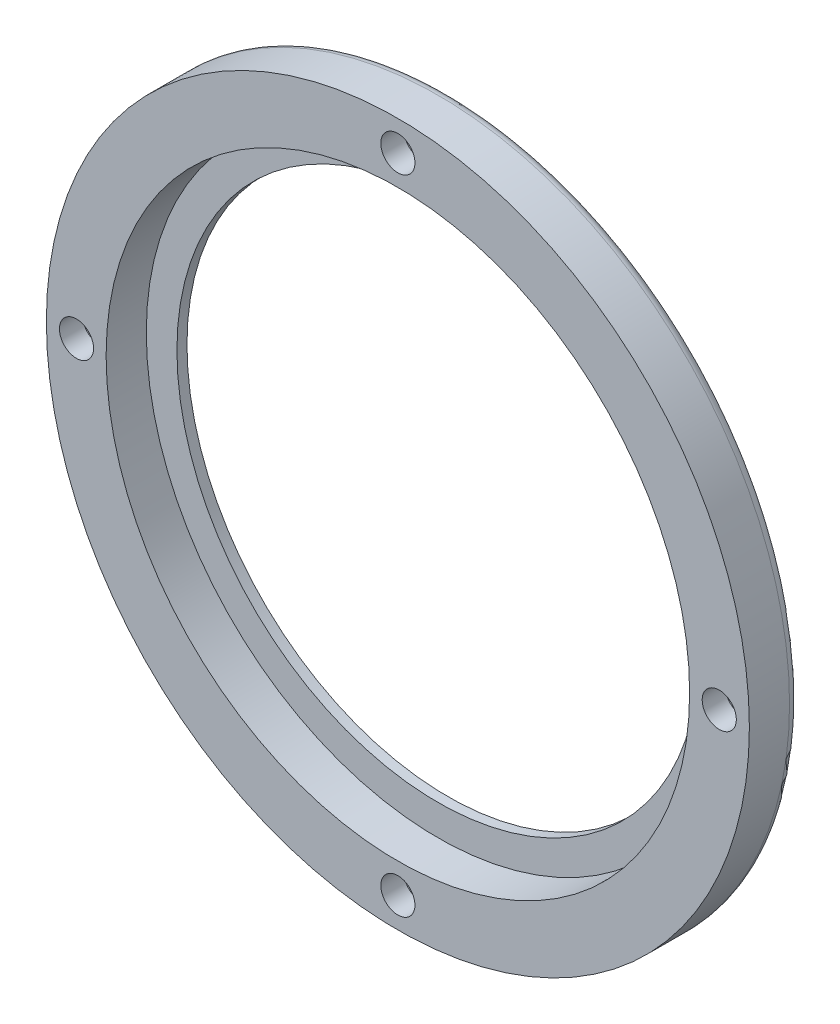
ISO-10303-21;
HEADER;
FILE_DESCRIPTION(('STEP AP214'),'2;1');
FILE_NAME('part.step','',(''),(''),'','','');
FILE_SCHEMA(('AUTOMOTIVE_DESIGN { 1 0 10303 214 1 1 1 1 }'));
ENDSEC;
DATA;
#1=APPLICATION_CONTEXT('core data for automotive mechanical design processes');
#2=APPLICATION_PROTOCOL_DEFINITION('international standard','automotive_design',2000,#1);
#3=PRODUCT_CONTEXT('',#1,'mechanical');
#4=PRODUCT('Part','Part','',(#3));
#5=PRODUCT_RELATED_PRODUCT_CATEGORY('part','',(#4));
#6=PRODUCT_DEFINITION_FORMATION('','',#4);
#7=PRODUCT_DEFINITION_CONTEXT('part definition',#1,'design');
#8=PRODUCT_DEFINITION('design','',#6,#7);
#9=PRODUCT_DEFINITION_SHAPE('','',#8);
#10=(LENGTH_UNIT() NAMED_UNIT(*) SI_UNIT(.MILLI.,.METRE.));
#11=(NAMED_UNIT(*) PLANE_ANGLE_UNIT() SI_UNIT($,.RADIAN.));
#12=(NAMED_UNIT(*) SI_UNIT($,.STERADIAN.) SOLID_ANGLE_UNIT());
#13=UNCERTAINTY_MEASURE_WITH_UNIT(LENGTH_MEASURE(1.E-05),#10,'distance_accuracy_value','');
#14=(GEOMETRIC_REPRESENTATION_CONTEXT(3) GLOBAL_UNCERTAINTY_ASSIGNED_CONTEXT((#13)) GLOBAL_UNIT_ASSIGNED_CONTEXT((#10,
#11,#12)) REPRESENTATION_CONTEXT('',''));
#15=CARTESIAN_POINT('',(0.,0.,0.));
#16=DIRECTION('',(0.,0.,1.));
#17=DIRECTION('',(1.,0.,0.));
#18=AXIS2_PLACEMENT_3D('',#15,#16,#17);
#19=CARTESIAN_POINT('',(-32.,0.,-29.));
#20=DIRECTION('',(0.,0.,-1.));
#21=DIRECTION('',(-1.,0.,0.));
#22=AXIS2_PLACEMENT_3D('',#19,#20,#21);
#23=CYLINDRICAL_SURFACE('',#22,1.69999999999999);
#24=CARTESIAN_POINT('',(-32.,0.,-24.));
#25=DIRECTION('',(0.,0.,-1.));
#26=DIRECTION('',(-1.,0.,0.));
#27=AXIS2_PLACEMENT_3D('',#24,#25,#26);
#28=CIRCLE('',#27,1.69999999999999);
#29=CARTESIAN_POINT('',(-33.7,0.,-24.));
#30=VERTEX_POINT('',#29);
#31=EDGE_CURVE('E114',#30,#30,#28,.T.);
#32=ORIENTED_EDGE('',*,*,#31,.F.);
#33=EDGE_LOOP('',(#32));
#34=FACE_BOUND('',#33,.T.);
#35=CARTESIAN_POINT('',(-32.,0.,-26.3));
#36=DIRECTION('',(0.,0.,-1.));
#37=DIRECTION('',(-1.,0.,0.));
#38=AXIS2_PLACEMENT_3D('',#35,#36,#37);
#39=CIRCLE('',#38,1.69999999999999);
#40=CARTESIAN_POINT('',(-33.7,0.,-26.3));
#41=VERTEX_POINT('',#40);
#42=EDGE_CURVE('E45',#41,#41,#39,.F.);
#43=ORIENTED_EDGE('',*,*,#42,.F.);
#44=EDGE_LOOP('',(#43));
#45=FACE_BOUND('',#44,.T.);
#46=ADVANCED_FACE('F40',(#34,#45),#23,.F.);
#47=CARTESIAN_POINT('',(0.,32.,-29.));
#48=DIRECTION('',(0.,0.,-1.));
#49=DIRECTION('',(-1.,0.,0.));
#50=AXIS2_PLACEMENT_3D('',#47,#48,#49);
#51=CYLINDRICAL_SURFACE('',#50,1.69999999999999);
#52=CARTESIAN_POINT('',(0.,32.,-24.));
#53=DIRECTION('',(0.,0.,-1.));
#54=DIRECTION('',(-1.,0.,0.));
#55=AXIS2_PLACEMENT_3D('',#52,#53,#54);
#56=CIRCLE('',#55,1.69999999999999);
#57=CARTESIAN_POINT('',(-1.69999999999999,32.,-24.));
#58=VERTEX_POINT('',#57);
#59=EDGE_CURVE('E119',#58,#58,#56,.T.);
#60=ORIENTED_EDGE('',*,*,#59,.F.);
#61=EDGE_LOOP('',(#60));
#62=FACE_BOUND('',#61,.T.);
#63=CARTESIAN_POINT('',(0.,32.,-26.3));
#64=DIRECTION('',(0.,0.,-1.));
#65=DIRECTION('',(-1.,0.,0.));
#66=AXIS2_PLACEMENT_3D('',#63,#64,#65);
#67=CIRCLE('',#66,1.69999999999999);
#68=CARTESIAN_POINT('',(-1.69999999999999,32.,-26.3));
#69=VERTEX_POINT('',#68);
#70=EDGE_CURVE('E163',#69,#69,#67,.F.);
#71=ORIENTED_EDGE('',*,*,#70,.F.);
#72=EDGE_LOOP('',(#71));
#73=FACE_BOUND('',#72,.T.);
#74=ADVANCED_FACE('F180',(#62,#73),#51,.F.);
#75=CARTESIAN_POINT('',(32.,0.,-29.));
#76=DIRECTION('',(0.,0.,-1.));
#77=DIRECTION('',(-1.,0.,0.));
#78=AXIS2_PLACEMENT_3D('',#75,#76,#77);
#79=CYLINDRICAL_SURFACE('',#78,1.69999999999999);
#80=CARTESIAN_POINT('',(32.,0.,-24.));
#81=DIRECTION('',(0.,0.,-1.));
#82=DIRECTION('',(-1.,0.,0.));
#83=AXIS2_PLACEMENT_3D('',#80,#81,#82);
#84=CIRCLE('',#83,1.69999999999999);
#85=CARTESIAN_POINT('',(30.3,0.,-24.));
#86=VERTEX_POINT('',#85);
#87=EDGE_CURVE('E122',#86,#86,#84,.T.);
#88=ORIENTED_EDGE('',*,*,#87,.F.);
#89=EDGE_LOOP('',(#88));
#90=FACE_BOUND('',#89,.T.);
#91=CARTESIAN_POINT('',(32.,0.,-26.3));
#92=DIRECTION('',(0.,0.,-1.));
#93=DIRECTION('',(-1.,0.,0.));
#94=AXIS2_PLACEMENT_3D('',#91,#92,#93);
#95=CIRCLE('',#94,1.69999999999999);
#96=CARTESIAN_POINT('',(30.3,0.,-26.3));
#97=VERTEX_POINT('',#96);
#98=EDGE_CURVE('E158',#97,#97,#95,.F.);
#99=ORIENTED_EDGE('',*,*,#98,.F.);
#100=EDGE_LOOP('',(#99));
#101=FACE_BOUND('',#100,.T.);
#102=ADVANCED_FACE('F186',(#90,#101),#79,.F.);
#103=CARTESIAN_POINT('',(0.,-32.,-29.));
#104=DIRECTION('',(0.,0.,-1.));
#105=DIRECTION('',(-1.,0.,0.));
#106=AXIS2_PLACEMENT_3D('',#103,#104,#105);
#107=CYLINDRICAL_SURFACE('',#106,1.69999999999999);
#108=CARTESIAN_POINT('',(0.,-32.,-24.));
#109=DIRECTION('',(0.,0.,-1.));
#110=DIRECTION('',(-1.,0.,0.));
#111=AXIS2_PLACEMENT_3D('',#108,#109,#110);
#112=CIRCLE('',#111,1.69999999999999);
#113=CARTESIAN_POINT('',(-1.69999999999999,-32.,-24.));
#114=VERTEX_POINT('',#113);
#115=EDGE_CURVE('E125',#114,#114,#112,.T.);
#116=ORIENTED_EDGE('',*,*,#115,.F.);
#117=EDGE_LOOP('',(#116));
#118=FACE_BOUND('',#117,.T.);
#119=CARTESIAN_POINT('',(0.,-32.,-26.3));
#120=DIRECTION('',(0.,0.,-1.));
#121=DIRECTION('',(-1.,0.,0.));
#122=AXIS2_PLACEMENT_3D('',#119,#120,#121);
#123=CIRCLE('',#122,1.69999999999999);
#124=CARTESIAN_POINT('',(-1.69999999999999,-32.,-26.3));
#125=VERTEX_POINT('',#124);
#126=EDGE_CURVE('E154',#125,#125,#123,.F.);
#127=ORIENTED_EDGE('',*,*,#126,.F.);
#128=EDGE_LOOP('',(#127));
#129=FACE_BOUND('',#128,.T.);
#130=ADVANCED_FACE('F200',(#118,#129),#107,.F.);
#131=CARTESIAN_POINT('',(0.,0.,-29.));
#132=DIRECTION('',(0.,0.,1.));
#133=DIRECTION('',(1.,0.,0.));
#134=AXIS2_PLACEMENT_3D('',#131,#132,#133);
#135=CYLINDRICAL_SURFACE('',#134,35.);
#136=CARTESIAN_POINT('',(0.,0.,-28.));
#137=DIRECTION('',(0.,0.,-1.));
#138=DIRECTION('',(-1.,0.,0.));
#139=AXIS2_PLACEMENT_3D('',#136,#137,#138);
#140=CIRCLE('',#139,35.);
#141=CARTESIAN_POINT('',(-35.,0.,-28.));
#142=VERTEX_POINT('',#141);
#143=EDGE_CURVE('E107',#142,#142,#140,.F.);
#144=ORIENTED_EDGE('',*,*,#143,.T.);
#145=EDGE_LOOP('',(#144));
#146=FACE_BOUND('',#145,.T.);
#147=CARTESIAN_POINT('',(0.,0.,-24.));
#148=DIRECTION('',(0.,0.,1.));
#149=DIRECTION('',(1.,0.,0.));
#150=AXIS2_PLACEMENT_3D('',#147,#148,#149);
#151=CIRCLE('',#150,35.);
#152=CARTESIAN_POINT('',(35.,0.,-24.));
#153=VERTEX_POINT('',#152);
#154=EDGE_CURVE('E110',#153,#153,#151,.T.);
#155=ORIENTED_EDGE('',*,*,#154,.F.);
#156=EDGE_LOOP('',(#155));
#157=FACE_BOUND('',#156,.T.);
#158=ADVANCED_FACE('F198',(#146,#157),#135,.T.);
#159=CARTESIAN_POINT('',(35.,0.,-29.));
#160=DIRECTION('',(0.,0.,-1.));
#161=DIRECTION('',(-1.,0.,0.));
#162=AXIS2_PLACEMENT_3D('',#159,#160,#161);
#163=PLANE('',#162);
#164=CARTESIAN_POINT('',(0.,-32.,-29.));
#165=DIRECTION('',(0.,0.,-1.));
#166=DIRECTION('',(-1.,0.,0.));
#167=AXIS2_PLACEMENT_3D('',#164,#165,#166);
#168=CIRCLE('',#167,2.8);
#169=CARTESIAN_POINT('',(-2.01900965822356,-33.94,-29.));
#170=VERTEX_POINT('',#169);
#171=CARTESIAN_POINT('',(2.01900965822355,-33.94,-29.));
#172=VERTEX_POINT('',#171);
#173=EDGE_CURVE('E63',#170,#172,#168,.T.);
#174=ORIENTED_EDGE('',*,*,#173,.F.);
#175=CARTESIAN_POINT('',(0.,0.,-29.));
#176=DIRECTION('',(0.,0.,-1.));
#177=DIRECTION('',(-1.,0.,0.));
#178=AXIS2_PLACEMENT_3D('',#175,#176,#177);
#179=CIRCLE('',#178,34.);
#180=CARTESIAN_POINT('',(-33.94,-2.0190096582239,-29.));
#181=VERTEX_POINT('',#180);
#182=EDGE_CURVE('E95',#170,#181,#179,.T.);
#183=ORIENTED_EDGE('',*,*,#182,.T.);
#184=CARTESIAN_POINT('',(-32.,-3.29214771340949E-13,-29.));
#185=DIRECTION('',(0.,0.,-1.));
#186=DIRECTION('',(-1.,0.,0.));
#187=AXIS2_PLACEMENT_3D('',#184,#185,#186);
#188=CIRCLE('',#187,2.8);
#189=CARTESIAN_POINT('',(-33.94,2.0190096582232,-29.));
#190=VERTEX_POINT('',#189);
#191=EDGE_CURVE('E57',#190,#181,#188,.T.);
#192=ORIENTED_EDGE('',*,*,#191,.F.);
#193=CARTESIAN_POINT('',(-2.01900965822379,33.94,-29.));
#194=VERTEX_POINT('',#193);
#195=EDGE_CURVE('E88',#190,#194,#179,.T.);
#196=ORIENTED_EDGE('',*,*,#195,.T.);
#197=CARTESIAN_POINT('',(-2.17487368497969E-13,32.,-29.));
#198=DIRECTION('',(0.,0.,-1.));
#199=DIRECTION('',(-1.,0.,0.));
#200=AXIS2_PLACEMENT_3D('',#197,#198,#199);
#201=CIRCLE('',#200,2.8);
#202=CARTESIAN_POINT('',(2.01900965822333,33.94,-29.));
#203=VERTEX_POINT('',#202);
#204=EDGE_CURVE('E144',#203,#194,#201,.T.);
#205=ORIENTED_EDGE('',*,*,#204,.F.);
#206=CARTESIAN_POINT('',(33.94,2.01900965822367,-29.));
#207=VERTEX_POINT('',#206);
#208=EDGE_CURVE('E102',#203,#207,#179,.T.);
#209=ORIENTED_EDGE('',*,*,#208,.T.);
#210=CARTESIAN_POINT('',(32.,1.05759965654989E-13,-29.));
#211=DIRECTION('',(0.,0.,-1.));
#212=DIRECTION('',(-1.,0.,0.));
#213=AXIS2_PLACEMENT_3D('',#210,#211,#212);
#214=CIRCLE('',#213,2.8);
#215=CARTESIAN_POINT('',(33.94,-2.01900965822344,-29.));
#216=VERTEX_POINT('',#215);
#217=EDGE_CURVE('E149',#216,#207,#214,.T.);
#218=ORIENTED_EDGE('',*,*,#217,.F.);
#219=EDGE_CURVE('E105',#216,#172,#179,.T.);
#220=ORIENTED_EDGE('',*,*,#219,.T.);
#221=EDGE_LOOP('',(#174,#183,#192,#196,#205,#209,#218,#220));
#222=FACE_BOUND('',#221,.T.);
#223=CARTESIAN_POINT('',(0.,0.,-29.));
#224=DIRECTION('',(0.,0.,1.));
#225=DIRECTION('',(1.,0.,0.));
#226=AXIS2_PLACEMENT_3D('',#223,#224,#225);
#227=CIRCLE('',#226,26.);
#228=CARTESIAN_POINT('',(26.,0.,-29.));
#229=VERTEX_POINT('',#228);
#230=EDGE_CURVE('E128',#229,#229,#227,.T.);
#231=ORIENTED_EDGE('',*,*,#230,.T.);
#232=EDGE_LOOP('',(#231));
#233=FACE_BOUND('',#232,.T.);
#234=ADVANCED_FACE('F92',(#222,#233),#163,.T.);
#235=CARTESIAN_POINT('',(0.,0.,-24.));
#236=DIRECTION('',(0.,0.,1.));
#237=DIRECTION('',(1.,0.,0.));
#238=AXIS2_PLACEMENT_3D('',#235,#236,#237);
#239=PLANE('',#238);
#240=CARTESIAN_POINT('',(0.,0.,-24.));
#241=DIRECTION('',(0.,0.,1.));
#242=DIRECTION('',(1.,0.,0.));
#243=AXIS2_PLACEMENT_3D('',#240,#241,#242);
#244=CIRCLE('',#243,29.05);
#245=CARTESIAN_POINT('',(29.05,0.,-24.));
#246=VERTEX_POINT('',#245);
#247=EDGE_CURVE('E137',#246,#246,#244,.T.);
#248=ORIENTED_EDGE('',*,*,#247,.F.);
#249=EDGE_LOOP('',(#248));
#250=FACE_BOUND('',#249,.T.);
#251=ORIENTED_EDGE('',*,*,#115,.T.);
#252=EDGE_LOOP('',(#251));
#253=FACE_BOUND('',#252,.T.);
#254=ORIENTED_EDGE('',*,*,#87,.T.);
#255=EDGE_LOOP('',(#254));
#256=FACE_BOUND('',#255,.T.);
#257=ORIENTED_EDGE('',*,*,#59,.T.);
#258=EDGE_LOOP('',(#257));
#259=FACE_BOUND('',#258,.T.);
#260=ORIENTED_EDGE('',*,*,#31,.T.);
#261=EDGE_LOOP('',(#260));
#262=FACE_BOUND('',#261,.T.);
#263=ORIENTED_EDGE('',*,*,#154,.T.);
#264=EDGE_LOOP('',(#263));
#265=FACE_BOUND('',#264,.T.);
#266=ADVANCED_FACE('F192',(#250,#253,#256,#259,#262,#265),#239,.T.);
#267=CARTESIAN_POINT('',(0.,0.,-24.));
#268=DIRECTION('',(0.,0.,1.));
#269=DIRECTION('',(1.,0.,0.));
#270=AXIS2_PLACEMENT_3D('',#267,#268,#269);
#271=CYLINDRICAL_SURFACE('',#270,26.);
#272=ORIENTED_EDGE('',*,*,#230,.F.);
#273=EDGE_LOOP('',(#272));
#274=FACE_BOUND('',#273,.T.);
#275=CARTESIAN_POINT('',(0.,0.,-28.));
#276=DIRECTION('',(0.,0.,1.));
#277=DIRECTION('',(1.,0.,0.));
#278=AXIS2_PLACEMENT_3D('',#275,#276,#277);
#279=CIRCLE('',#278,26.);
#280=CARTESIAN_POINT('',(26.,0.,-28.));
#281=VERTEX_POINT('',#280);
#282=EDGE_CURVE('E131',#281,#281,#279,.T.);
#283=ORIENTED_EDGE('',*,*,#282,.T.);
#284=EDGE_LOOP('',(#283));
#285=FACE_BOUND('',#284,.T.);
#286=ADVANCED_FACE('F195',(#274,#285),#271,.F.);
#287=CARTESIAN_POINT('',(26.,0.,-28.));
#288=DIRECTION('',(0.,0.,-1.));
#289=DIRECTION('',(-1.,0.,0.));
#290=AXIS2_PLACEMENT_3D('',#287,#288,#289);
#291=PLANE('',#290);
#292=ORIENTED_EDGE('',*,*,#282,.F.);
#293=EDGE_LOOP('',(#292));
#294=FACE_BOUND('',#293,.T.);
#295=CARTESIAN_POINT('',(0.,0.,-28.));
#296=DIRECTION('',(0.,0.,1.));
#297=DIRECTION('',(1.,0.,0.));
#298=AXIS2_PLACEMENT_3D('',#295,#296,#297);
#299=CIRCLE('',#298,29.05);
#300=CARTESIAN_POINT('',(29.05,0.,-28.));
#301=VERTEX_POINT('',#300);
#302=EDGE_CURVE('E134',#301,#301,#299,.T.);
#303=ORIENTED_EDGE('',*,*,#302,.T.);
#304=EDGE_LOOP('',(#303));
#305=FACE_BOUND('',#304,.T.);
#306=ADVANCED_FACE('F218',(#294,#305),#291,.F.);
#307=CARTESIAN_POINT('',(0.,0.,-24.));
#308=DIRECTION('',(0.,0.,1.));
#309=DIRECTION('',(1.,0.,0.));
#310=AXIS2_PLACEMENT_3D('',#307,#308,#309);
#311=CYLINDRICAL_SURFACE('',#310,29.05);
#312=ORIENTED_EDGE('',*,*,#302,.F.);
#313=EDGE_LOOP('',(#312));
#314=FACE_BOUND('',#313,.T.);
#315=ORIENTED_EDGE('',*,*,#247,.T.);
#316=EDGE_LOOP('',(#315));
#317=FACE_BOUND('',#316,.T.);
#318=ADVANCED_FACE('F222',(#314,#317),#311,.F.);
#319=CARTESIAN_POINT('',(0.,0.,-28.));
#320=DIRECTION('',(0.,0.,-1.));
#321=DIRECTION('',(-1.,0.,0.));
#322=AXIS2_PLACEMENT_3D('',#319,#320,#321);
#323=TOROIDAL_SURFACE('',#322,34.,1.);
#324=CARTESIAN_POINT('',(2.65373843804049,-32.893125020625,-27.9998));
#325=CARTESIAN_POINT('',(2.65373821407248,-32.8931190466075,-28.0258151181649));
#326=CARTESIAN_POINT('',(2.65338969688123,-32.8941619710773,-28.0518179000067));
#327=CARTESIAN_POINT('',(2.65198304225009,-32.8983279453459,-28.10363496629));
#328=CARTESIAN_POINT('',(2.6509249585492,-32.9014508376183,-28.1294492648568));
#329=CARTESIAN_POINT('',(2.64667327298988,-32.9138940591094,-28.2062515095137));
#330=CARTESIAN_POINT('',(2.64240234831206,-32.9262890894787,-28.2567201625924));
#331=CARTESIAN_POINT('',(2.63078406422212,-32.9587851943112,-28.3547293892269));
#332=CARTESIAN_POINT('',(2.62343544083313,-32.9788894345751,-28.4022687505428));
#333=CARTESIAN_POINT('',(2.6053900484537,-33.0259507096185,-28.4931203839764));
#334=CARTESIAN_POINT('',(2.59469397128725,-33.052906328196,-28.5364335271096));
#335=CARTESIAN_POINT('',(2.56959145307943,-33.1127704853801,-28.6181289572856));
#336=CARTESIAN_POINT('',(2.55515309412224,-33.1457294700289,-28.6564643449933));
#337=CARTESIAN_POINT('',(2.52246496687858,-33.2160060842404,-28.7270160829243));
#338=CARTESIAN_POINT('',(2.50421418215865,-33.2533248750022,-28.759230796928));
#339=CARTESIAN_POINT('',(2.46285409627193,-33.3328378105412,-28.8187353655399));
#340=CARTESIAN_POINT('',(2.439539423184,-33.3751852464491,-28.8456761655856));
#341=CARTESIAN_POINT('',(2.38893072463784,-33.461340099756,-28.8925140275196));
#342=CARTESIAN_POINT('',(2.36163500233764,-33.5051481335326,-28.9124080734117));
#343=CARTESIAN_POINT('',(2.29171313289472,-33.6104225073959,-28.9523034453204));
#344=CARTESIAN_POINT('',(2.24732952414583,-33.6719231642295,-28.9691467332743));
#345=CARTESIAN_POINT('',(2.15259020875653,-33.7922804262563,-28.9919669941654));
#346=CARTESIAN_POINT('',(2.10222253082862,-33.8511313951814,-28.9979217808674));
#347=CARTESIAN_POINT('',(1.97515597588234,-33.9876129729519,-29.001819754949));
#348=CARTESIAN_POINT('',(1.89608243917311,-34.0631407081418,-28.9955168842141));
#349=CARTESIAN_POINT('',(1.73080590587449,-34.2036708907715,-28.9712486624856));
#350=CARTESIAN_POINT('',(1.64458986435942,-34.2686534086563,-28.9532615428363));
#351=CARTESIAN_POINT('',(1.42515222732544,-34.4152723711911,-28.899985500689));
#352=CARTESIAN_POINT('',(1.28871071048984,-34.4906078571806,-28.8605405812951));
#353=CARTESIAN_POINT('',(1.07693719499976,-34.5857732078791,-28.798957163144));
#354=CARTESIAN_POINT('',(1.0050496680844,-34.6145511833715,-28.7779940183052));
#355=CARTESIAN_POINT('',(0.858939108661526,-34.6661254626309,-28.7369396291175));
#356=CARTESIAN_POINT('',(0.784717094463856,-34.6889243350605,-28.7168480134602));
#357=CARTESIAN_POINT('',(0.602383790257932,-34.7366629016418,-28.6717283739965));
#358=CARTESIAN_POINT('',(0.493043033641812,-34.7585332735713,-28.6481338780224));
#359=CARTESIAN_POINT('',(0.326542603476156,-34.7814541656034,-28.6221939427659));
#360=CARTESIAN_POINT('',(0.270779455795232,-34.7874440885012,-28.6151289647181));
#361=CARTESIAN_POINT('',(0.158633786769969,-34.7960677336684,-28.6048268950359));
#362=CARTESIAN_POINT('',(0.102251391818099,-34.7987021284393,-28.6015890363948));
#363=CARTESIAN_POINT('',(-0.0110049568494012,-34.8005544469146,-28.5993219098841));
#364=CARTESIAN_POINT('',(-0.067879801576919,-34.799751267349,-28.6003186378677));
#365=CARTESIAN_POINT('',(-0.181243620825745,-34.7947046956214,-28.6064489843618));
#366=CARTESIAN_POINT('',(-0.237732538085481,-34.7904608036658,-28.6115832038785));
#367=CARTESIAN_POINT('',(-0.40659324761,-34.772638906059,-28.6324176006427));
#368=CARTESIAN_POINT('',(-0.517779866410676,-34.7539626066463,-28.6535519863342));
#369=CARTESIAN_POINT('',(-0.704637711291285,-34.7110771184084,-28.69631774166));
#370=CARTESIAN_POINT('',(-0.781501550834118,-34.6899020054528,-28.7161370880123));
#371=CARTESIAN_POINT('',(-0.932798625329376,-34.6412493618487,-28.7573521233355));
#372=CARTESIAN_POINT('',(-1.00723055654816,-34.6137685120622,-28.7787486384373));
#373=CARTESIAN_POINT('',(-1.22656658787165,-34.5220268064617,-28.842371763511));
#374=CARTESIAN_POINT('',(-1.36790454516028,-34.4483757607798,-28.8841422194802));
#375=CARTESIAN_POINT('',(-1.59116228379905,-34.3063128965461,-28.9410312960685));
#376=CARTESIAN_POINT('',(-1.67659739820294,-34.245051011675,-28.9603633078304));
#377=CARTESIAN_POINT('',(-1.8410243780989,-34.1122804231219,-28.9888658167537));
#378=CARTESIAN_POINT('',(-1.92002687993345,-34.0407891966939,-28.9980534173283));
#379=CARTESIAN_POINT('',(-2.05025435070161,-33.9085917613101,-29.0009662294208));
#380=CARTESIAN_POINT('',(-2.10338977424015,-33.8498565835585,-28.9980670463568));
#381=CARTESIAN_POINT('',(-2.2038317739609,-33.7289480555411,-28.9816560417459));
#382=CARTESIAN_POINT('',(-2.25114705162235,-33.6667800442811,-28.968160291383));
#383=CARTESIAN_POINT('',(-2.32977540894313,-33.5543042902168,-28.9323722668719));
#384=CARTESIAN_POINT('',(-2.36238460155226,-33.5041612156638,-28.9124329205289));
#385=CARTESIAN_POINT('',(-2.4225503050798,-33.4052026228927,-28.8635291224695));
#386=CARTESIAN_POINT('',(-2.45010850219171,-33.3563866662895,-28.834567691379));
#387=CARTESIAN_POINT('',(-2.49996593970108,-33.2621555293493,-28.767077053303));
#388=CARTESIAN_POINT('',(-2.5222262266286,-33.2167671188922,-28.7284810094662));
#389=CARTESIAN_POINT('',(-2.56117259009591,-33.1325000990615,-28.6423721329936));
#390=CARTESIAN_POINT('',(-2.57786183779263,-33.09361779258,-28.5948643972266));
#391=CARTESIAN_POINT('',(-2.60425352629302,-33.0290453661528,-28.4986732898945));
#392=CARTESIAN_POINT('',(-2.61456082669956,-33.0023234169477,-28.4508442813286));
#393=CARTESIAN_POINT('',(-2.63145519196444,-32.9570938253207,-28.3508421830114));
#394=CARTESIAN_POINT('',(-2.63804429043352,-32.9385816938595,-28.2986714858291));
#395=CARTESIAN_POINT('',(-2.64657789431077,-32.9141944935437,-28.2052647706613));
#396=CARTESIAN_POINT('',(-2.64927633465211,-32.9063056580751,-28.1646089525608));
#397=CARTESIAN_POINT('',(-2.65285177115867,-32.895759152967,-28.0825752619808));
#398=CARTESIAN_POINT('',(-2.65373004039926,-32.8930978271383,-28.041197914598));
#399=CARTESIAN_POINT('',(-2.6537384380405,-32.893125020625,-27.9998));
#400=B_SPLINE_CURVE_WITH_KNOTS('',3,(#324,#325,#326,#327,#328,#329,#330,#331,#332,#333,#334,
#335,#336,#337,#338,#339,#340,#341,#342,#343,#344,#345,#346,#347,#348,#349,#350,#351,#352,#353,
#354,#355,#356,#357,#358,#359,#360,#361,#362,#363,#364,#365,#366,#367,#368,#369,#370,#371,#372,
#373,#374,#375,#376,#377,#378,#379,#380,#381,#382,#383,#384,#385,#386,#387,#388,#389,#390,#391,
#392,#393,#394,#395,#396,#397,#398,#399),.UNSPECIFIED.,.F.,.F.,(4,2,2,2,2,2,2,2,2,2,2,2,2,2,2,2,
2,2,2,2,2,2,2,2,2,2,2,2,2,2,2,2,2,2,2,2,2,4),(0.,0.0779969440770664,0.155987981724885,
0.311610669095286,0.467297331755223,0.622951839611275,0.779980306655734,0.937050692723896,
1.10239953516499,1.26781906130211,1.49959347196809,1.73183961842949,2.05859066947505,
2.3859522356733,2.86549347516514,3.10597353359443,3.3463501103219,3.68692912035112,
3.85631823062024,4.02567338725268,4.19606970163989,4.3664907720214,4.70904453633523,
4.95524167914877,5.20156871074294,5.69297996564708,6.01280725856516,6.33209449737899,
6.56906897485057,6.80568473980989,6.99408387486429,7.18242000088909,7.37210083396342,
7.56167351172341,7.7280615138094,7.89435842423127,8.01850405563896,8.14256282699428),.UNSPECIFIED.);
#401=EDGE_CURVE('E11',#172,#170,#400,.T.);
#402=ORIENTED_EDGE('',*,*,#401,.F.);
#403=ORIENTED_EDGE('',*,*,#219,.F.);
#404=CARTESIAN_POINT('',(32.893125020625,2.6537384380406,-27.9998));
#405=CARTESIAN_POINT('',(32.8931190466075,2.6537382140726,-28.0258151181649));
#406=CARTESIAN_POINT('',(32.8941619710773,2.65338969688135,-28.0518179000067));
#407=CARTESIAN_POINT('',(32.8983279453458,2.6519830422502,-28.10363496629));
#408=CARTESIAN_POINT('',(32.9014508376182,2.65092495854931,-28.1294492648568));
#409=CARTESIAN_POINT('',(32.9138940591094,2.64667327299,-28.2062515095137));
#410=CARTESIAN_POINT('',(32.9262890894787,2.64240234831217,-28.2567201625924));
#411=CARTESIAN_POINT('',(32.9587851943112,2.63078406422224,-28.3547293892269));
#412=CARTESIAN_POINT('',(32.9788894345751,2.62343544083325,-28.4022687505428));
#413=CARTESIAN_POINT('',(33.0259507096185,2.60539004845382,-28.4931203839764));
#414=CARTESIAN_POINT('',(33.052906328196,2.59469397128737,-28.5364335271096));
#415=CARTESIAN_POINT('',(33.1127704853801,2.56959145307954,-28.6181289572856));
#416=CARTESIAN_POINT('',(33.1457294700289,2.55515309412236,-28.6564643449933));
#417=CARTESIAN_POINT('',(33.2160060842404,2.52246496687869,-28.7270160829243));
#418=CARTESIAN_POINT('',(33.2533248750022,2.50421418215876,-28.759230796928));
#419=CARTESIAN_POINT('',(33.3328378105412,2.46285409627205,-28.8187353655399));
#420=CARTESIAN_POINT('',(33.3751852464491,2.43953942318412,-28.8456761655856));
#421=CARTESIAN_POINT('',(33.461340099756,2.38893072463797,-28.8925140275196));
#422=CARTESIAN_POINT('',(33.5051481335325,2.36163500233777,-28.9124080734117));
#423=CARTESIAN_POINT('',(33.6104225073959,2.29171313289484,-28.9523034453204));
#424=CARTESIAN_POINT('',(33.6719231642295,2.24732952414595,-28.9691467332743));
#425=CARTESIAN_POINT('',(33.7922804262563,2.15259020875666,-28.9919669941654));
#426=CARTESIAN_POINT('',(33.8511313951813,2.10222253082875,-28.9979217808674));
#427=CARTESIAN_POINT('',(33.9876129729519,1.97515597588248,-29.001819754949));
#428=CARTESIAN_POINT('',(34.0631407081418,1.89608243917325,-28.9955168842141));
#429=CARTESIAN_POINT('',(34.2036708907714,1.73080590587463,-28.9712486624856));
#430=CARTESIAN_POINT('',(34.2686534086563,1.64458986435957,-28.9532615428363));
#431=CARTESIAN_POINT('',(34.4152723711911,1.42515222732559,-28.8999855006891));
#432=CARTESIAN_POINT('',(34.4906078571806,1.28871071048999,-28.8605405812951));
#433=CARTESIAN_POINT('',(34.5857732078791,1.07693719499991,-28.798957163144));
#434=CARTESIAN_POINT('',(34.6145511833714,1.00504966808455,-28.7779940183052));
#435=CARTESIAN_POINT('',(34.6661254626309,0.858939108661686,-28.7369396291176));
#436=CARTESIAN_POINT('',(34.6889243350605,0.784717094464018,-28.7168480134602));
#437=CARTESIAN_POINT('',(34.7366629016418,0.602383790258096,-28.6717283739965));
#438=CARTESIAN_POINT('',(34.7585332735713,0.493043033641975,-28.6481338780224));
#439=CARTESIAN_POINT('',(34.7814541656034,0.326542603476317,-28.6221939427659));
#440=CARTESIAN_POINT('',(34.7874440885012,0.270779455795392,-28.6151289647181));
#441=CARTESIAN_POINT('',(34.7960677336684,0.158633786770127,-28.6048268950359));
#442=CARTESIAN_POINT('',(34.7987021284393,0.102251391818257,-28.6015890363948));
#443=CARTESIAN_POINT('',(34.8005544469146,-0.0110049568492453,-28.5993219098841));
#444=CARTESIAN_POINT('',(34.799751267349,-0.0678798015767638,-28.6003186378677));
#445=CARTESIAN_POINT('',(34.7947046956214,-0.181243620825591,-28.6064489843618));
#446=CARTESIAN_POINT('',(34.7904608036658,-0.237732538085329,-28.6115832038785));
#447=CARTESIAN_POINT('',(34.772638906059,-0.406593247609851,-28.6324176006427));
#448=CARTESIAN_POINT('',(34.7539626066463,-0.517779866410527,-28.6535519863342));
#449=CARTESIAN_POINT('',(34.7110771184084,-0.704637711291139,-28.69631774166));
#450=CARTESIAN_POINT('',(34.6899020054529,-0.781501550833973,-28.7161370880123));
#451=CARTESIAN_POINT('',(34.6412493618488,-0.932798625329232,-28.7573521233355));
#452=CARTESIAN_POINT('',(34.6137685120623,-1.00723055654802,-28.7787486384373));
#453=CARTESIAN_POINT('',(34.5220268064617,-1.22656658787151,-28.842371763511));
#454=CARTESIAN_POINT('',(34.4483757607799,-1.36790454516013,-28.8841422194802));
#455=CARTESIAN_POINT('',(34.3063128965461,-1.59116228379891,-28.9410312960685));
#456=CARTESIAN_POINT('',(34.245051011675,-1.6765973982028,-28.9603633078304));
#457=CARTESIAN_POINT('',(34.1122804231219,-1.84102437809877,-28.9888658167537));
#458=CARTESIAN_POINT('',(34.0407891966939,-1.92002687993332,-28.9980534173283));
#459=CARTESIAN_POINT('',(33.9085917613101,-2.05025435070148,-29.0009662294208));
#460=CARTESIAN_POINT('',(33.8498565835585,-2.10338977424003,-28.9980670463568));
#461=CARTESIAN_POINT('',(33.7289480555411,-2.20383177396077,-28.9816560417459));
#462=CARTESIAN_POINT('',(33.6667800442811,-2.25114705162222,-28.968160291383));
#463=CARTESIAN_POINT('',(33.5543042902168,-2.32977540894301,-28.9323722668719));
#464=CARTESIAN_POINT('',(33.5041612156638,-2.36238460155214,-28.9124329205289));
#465=CARTESIAN_POINT('',(33.4052026228927,-2.42255030507969,-28.8635291224695));
#466=CARTESIAN_POINT('',(33.3563866662895,-2.4501085021916,-28.834567691379));
#467=CARTESIAN_POINT('',(33.2621555293493,-2.49996593970096,-28.767077053303));
#468=CARTESIAN_POINT('',(33.2167671188922,-2.52222622662849,-28.7284810094662));
#469=CARTESIAN_POINT('',(33.1325000990615,-2.5611725900958,-28.6423721329936));
#470=CARTESIAN_POINT('',(33.09361779258,-2.57786183779252,-28.5948643972266));
#471=CARTESIAN_POINT('',(33.0290453661528,-2.60425352629291,-28.4986732898945));
#472=CARTESIAN_POINT('',(33.0023234169477,-2.61456082669945,-28.4508442813286));
#473=CARTESIAN_POINT('',(32.9570938253207,-2.63145519196433,-28.3508421830114));
#474=CARTESIAN_POINT('',(32.9385816938595,-2.6380442904334,-28.2986714858291));
#475=CARTESIAN_POINT('',(32.9141944935437,-2.64657789431065,-28.2052647706613));
#476=CARTESIAN_POINT('',(32.9063056580751,-2.64927633465199,-28.1646089525608));
#477=CARTESIAN_POINT('',(32.895759152967,-2.65285177115856,-28.0825752619808));
#478=CARTESIAN_POINT('',(32.8930978271383,-2.65373004039914,-28.041197914598));
#479=CARTESIAN_POINT('',(32.893125020625,-2.65373843804039,-27.9998));
#480=B_SPLINE_CURVE_WITH_KNOTS('',3,(#404,#405,#406,#407,#408,#409,#410,#411,#412,#413,#414,
#415,#416,#417,#418,#419,#420,#421,#422,#423,#424,#425,#426,#427,#428,#429,#430,#431,#432,#433,
#434,#435,#436,#437,#438,#439,#440,#441,#442,#443,#444,#445,#446,#447,#448,#449,#450,#451,#452,
#453,#454,#455,#456,#457,#458,#459,#460,#461,#462,#463,#464,#465,#466,#467,#468,#469,#470,#471,
#472,#473,#474,#475,#476,#477,#478,#479),.UNSPECIFIED.,.F.,.F.,(4,2,2,2,2,2,2,2,2,2,2,2,2,2,2,2,
2,2,2,2,2,2,2,2,2,2,2,2,2,2,2,2,2,2,2,2,2,4),(0.,0.0779969440770733,0.155987981724884,
0.311610669095287,0.467297331755224,0.622951839611276,0.779980306655735,0.937050692723889,
1.10239953516498,1.26781906130209,1.49959347196808,1.73183961842947,2.05859066947503,
2.38595223567327,2.8654934751651,3.10597353359439,3.34635011032185,3.68692912035108,
3.8563182306202,4.02567338725265,4.19606970163986,4.36649077202137,4.7090445363352,
4.95524167914874,5.20156871074291,5.69297996564705,6.01280725856514,6.33209449737898,
6.56906897485056,6.80568473980988,6.99408387486429,7.18242000088909,7.37210083396343,
7.56167351172341,7.72806151380941,7.89435842423128,8.01850405563896,8.14256282699427),.UNSPECIFIED.);
#481=EDGE_CURVE('E50',#207,#216,#480,.T.);
#482=ORIENTED_EDGE('',*,*,#481,.F.);
#483=ORIENTED_EDGE('',*,*,#208,.F.);
#484=CARTESIAN_POINT('',(-2.65373843804072,32.893125020625,-27.9998));
#485=CARTESIAN_POINT('',(-2.65373821407272,32.8931190466075,-28.0258151181649));
#486=CARTESIAN_POINT('',(-2.65338969688146,32.8941619710772,-28.0518179000067));
#487=CARTESIAN_POINT('',(-2.65198304225032,32.8983279453458,-28.10363496629));
#488=CARTESIAN_POINT('',(-2.65092495854943,32.9014508376182,-28.1294492648568));
#489=CARTESIAN_POINT('',(-2.64667327299011,32.9138940591094,-28.2062515095137));
#490=CARTESIAN_POINT('',(-2.64240234831229,32.9262890894787,-28.2567201625924));
#491=CARTESIAN_POINT('',(-2.63078406422235,32.9587851943112,-28.3547293892269));
#492=CARTESIAN_POINT('',(-2.62343544083337,32.9788894345751,-28.4022687505428));
#493=CARTESIAN_POINT('',(-2.60539004845394,33.0259507096185,-28.4931203839764));
#494=CARTESIAN_POINT('',(-2.59469397128749,33.0529063281959,-28.5364335271096));
#495=CARTESIAN_POINT('',(-2.56959145307966,33.1127704853801,-28.6181289572856));
#496=CARTESIAN_POINT('',(-2.55515309412248,33.1457294700289,-28.6564643449933));
#497=CARTESIAN_POINT('',(-2.52246496687882,33.2160060842404,-28.7270160829243));
#498=CARTESIAN_POINT('',(-2.50421418215889,33.2533248750022,-28.7592307969279));
#499=CARTESIAN_POINT('',(-2.46285409627218,33.3328378105412,-28.8187353655399));
#500=CARTESIAN_POINT('',(-2.43953942318424,33.3751852464491,-28.8456761655856));
#501=CARTESIAN_POINT('',(-2.38893072463809,33.461340099756,-28.8925140275196));
#502=CARTESIAN_POINT('',(-2.36163500233789,33.5051481335325,-28.9124080734117));
#503=CARTESIAN_POINT('',(-2.29171313289496,33.6104225073959,-28.9523034453204));
#504=CARTESIAN_POINT('',(-2.24732952414607,33.6719231642295,-28.9691467332743));
#505=CARTESIAN_POINT('',(-2.15259020875677,33.7922804262563,-28.9919669941654));
#506=CARTESIAN_POINT('',(-2.10222253082886,33.8511313951813,-28.9979217808674));
#507=CARTESIAN_POINT('',(-1.9751559758826,33.9876129729519,-29.001819754949));
#508=CARTESIAN_POINT('',(-1.89608243917337,34.0631407081418,-28.9955168842141));
#509=CARTESIAN_POINT('',(-1.73080590587475,34.2036708907714,-28.9712486624856));
#510=CARTESIAN_POINT('',(-1.64458986435968,34.2686534086562,-28.9532615428363));
#511=CARTESIAN_POINT('',(-1.4251522273257,34.4152723711911,-28.899985500689));
#512=CARTESIAN_POINT('',(-1.2887107104901,34.4906078571806,-28.8605405812951));
#513=CARTESIAN_POINT('',(-1.07693719500002,34.5857732078791,-28.798957163144));
#514=CARTESIAN_POINT('',(-1.00504966808467,34.6145511833714,-28.7779940183052));
#515=CARTESIAN_POINT('',(-0.858939108661798,34.6661254626309,-28.7369396291175));
#516=CARTESIAN_POINT('',(-0.784717094464129,34.6889243350605,-28.7168480134602));
#517=CARTESIAN_POINT('',(-0.602383790258207,34.7366629016418,-28.6717283739965));
#518=CARTESIAN_POINT('',(-0.493043033642087,34.7585332735713,-28.6481338780224));
#519=CARTESIAN_POINT('',(-0.326542603476431,34.7814541656034,-28.6221939427659));
#520=CARTESIAN_POINT('',(-0.270779455795507,34.7874440885012,-28.6151289647181));
#521=CARTESIAN_POINT('',(-0.158633786770242,34.7960677336684,-28.6048268950359));
#522=CARTESIAN_POINT('',(-0.10225139181837,34.7987021284393,-28.6015890363948));
#523=CARTESIAN_POINT('',(0.0110049568491319,34.8005544469146,-28.5993219098841));
#524=CARTESIAN_POINT('',(0.0678798015766501,34.799751267349,-28.6003186378677));
#525=CARTESIAN_POINT('',(0.181243620825477,34.7947046956214,-28.6064489843618));
#526=CARTESIAN_POINT('',(0.237732538085216,34.7904608036658,-28.6115832038785));
#527=CARTESIAN_POINT('',(0.406593247609737,34.772638906059,-28.6324176006427));
#528=CARTESIAN_POINT('',(0.517779866410413,34.7539626066463,-28.6535519863342));
#529=CARTESIAN_POINT('',(0.704637711291024,34.7110771184084,-28.69631774166));
#530=CARTESIAN_POINT('',(0.781501550833857,34.6899020054529,-28.7161370880123));
#531=CARTESIAN_POINT('',(0.932798625329114,34.6412493618487,-28.7573521233355));
#532=CARTESIAN_POINT('',(1.0072305565479,34.6137685120623,-28.7787486384373));
#533=CARTESIAN_POINT('',(1.22656658787139,34.5220268064617,-28.842371763511));
#534=CARTESIAN_POINT('',(1.36790454516001,34.4483757607799,-28.8841422194802));
#535=CARTESIAN_POINT('',(1.59116228379879,34.3063128965461,-28.9410312960685));
#536=CARTESIAN_POINT('',(1.67659739820269,34.245051011675,-28.9603633078303));
#537=CARTESIAN_POINT('',(1.84102437809865,34.1122804231219,-28.9888658167537));
#538=CARTESIAN_POINT('',(1.9200268799332,34.0407891966939,-28.9980534173283));
#539=CARTESIAN_POINT('',(2.05025435070136,33.9085917613101,-29.0009662294208));
#540=CARTESIAN_POINT('',(2.1033897742399,33.8498565835585,-28.9980670463568));
#541=CARTESIAN_POINT('',(2.20383177396065,33.7289480555412,-28.9816560417459));
#542=CARTESIAN_POINT('',(2.2511470516221,33.6667800442811,-28.968160291383));
#543=CARTESIAN_POINT('',(2.32977540894289,33.5543042902169,-28.9323722668719));
#544=CARTESIAN_POINT('',(2.36238460155202,33.5041612156638,-28.9124329205289));
#545=CARTESIAN_POINT('',(2.42255030507957,33.4052026228927,-28.8635291224695));
#546=CARTESIAN_POINT('',(2.45010850219148,33.3563866662895,-28.834567691379));
#547=CARTESIAN_POINT('',(2.49996593970085,33.2621555293493,-28.767077053303));
#548=CARTESIAN_POINT('',(2.52222622662837,33.2167671188923,-28.7284810094662));
#549=CARTESIAN_POINT('',(2.56117259009568,33.1325000990615,-28.6423721329936));
#550=CARTESIAN_POINT('',(2.57786183779241,33.09361779258,-28.5948643972266));
#551=CARTESIAN_POINT('',(2.60425352629279,33.0290453661528,-28.4986732898945));
#552=CARTESIAN_POINT('',(2.61456082669933,33.0023234169477,-28.4508442813286));
#553=CARTESIAN_POINT('',(2.63145519196421,32.9570938253207,-28.3508421830114));
#554=CARTESIAN_POINT('',(2.63804429043329,32.9385816938595,-28.2986714858291));
#555=CARTESIAN_POINT('',(2.64657789431054,32.9141944935437,-28.2052647706613));
#556=CARTESIAN_POINT('',(2.64927633465188,32.9063056580751,-28.1646089525607));
#557=CARTESIAN_POINT('',(2.65285177115844,32.895759152967,-28.0825752619808));
#558=CARTESIAN_POINT('',(2.65373004039903,32.8930978271383,-28.041197914598));
#559=CARTESIAN_POINT('',(2.65373843804027,32.893125020625,-27.9998));
#560=B_SPLINE_CURVE_WITH_KNOTS('',3,(#484,#485,#486,#487,#488,#489,#490,#491,#492,#493,#494,
#495,#496,#497,#498,#499,#500,#501,#502,#503,#504,#505,#506,#507,#508,#509,#510,#511,#512,#513,
#514,#515,#516,#517,#518,#519,#520,#521,#522,#523,#524,#525,#526,#527,#528,#529,#530,#531,#532,
#533,#534,#535,#536,#537,#538,#539,#540,#541,#542,#543,#544,#545,#546,#547,#548,#549,#550,#551,
#552,#553,#554,#555,#556,#557,#558,#559),.UNSPECIFIED.,.F.,.F.,(4,2,2,2,2,2,2,2,2,2,2,2,2,2,2,2,
2,2,2,2,2,2,2,2,2,2,2,2,2,2,2,2,2,2,2,2,2,4),(0.,0.0779969440770664,0.155987981724881,
0.311610669095279,0.46729733175521,0.622951839611264,0.779980306655717,0.937050692723873,
1.10239953516497,1.26781906130209,1.49959347196808,1.73183961842947,2.05859066947502,
2.38595223567327,2.86549347516511,3.1059735335944,3.34635011032186,3.68692912035108,
3.85631823062021,4.02567338725266,4.19606970163987,4.36649077202138,4.70904453633521,
4.95524167914875,5.20156871074292,5.69297996564705,6.01280725856515,6.33209449737898,
6.56906897485056,6.80568473980988,6.99408387486429,7.18242000088909,7.37210083396343,
7.56167351172342,7.72806151380941,7.89435842423129,8.01850405563897,8.14256282699428),.UNSPECIFIED.);
#561=EDGE_CURVE('E87',#194,#203,#560,.T.);
#562=ORIENTED_EDGE('',*,*,#561,.F.);
#563=ORIENTED_EDGE('',*,*,#195,.F.);
#564=CARTESIAN_POINT('',(-32.893125020625,-2.65373843804083,-27.9998));
#565=CARTESIAN_POINT('',(-32.8931190466075,-2.65373821407283,-28.0258151181649));
#566=CARTESIAN_POINT('',(-32.8941619710772,-2.65338969688158,-28.0518179000067));
#567=CARTESIAN_POINT('',(-32.8983279453458,-2.65198304225043,-28.10363496629));
#568=CARTESIAN_POINT('',(-32.9014508376182,-2.65092495854954,-28.1294492648568));
#569=CARTESIAN_POINT('',(-32.9138940591094,-2.64667327299022,-28.2062515095137));
#570=CARTESIAN_POINT('',(-32.9262890894787,-2.6424023483124,-28.2567201625924));
#571=CARTESIAN_POINT('',(-32.9587851943112,-2.63078406422246,-28.3547293892269));
#572=CARTESIAN_POINT('',(-32.9788894345751,-2.62343544083347,-28.4022687505428));
#573=CARTESIAN_POINT('',(-33.0259507096185,-2.60539004845405,-28.4931203839764));
#574=CARTESIAN_POINT('',(-33.0529063281959,-2.5946939712876,-28.5364335271096));
#575=CARTESIAN_POINT('',(-33.11277048538,-2.56959145307978,-28.6181289572856));
#576=CARTESIAN_POINT('',(-33.1457294700289,-2.55515309412259,-28.6564643449933));
#577=CARTESIAN_POINT('',(-33.2160060842404,-2.52246496687892,-28.7270160829243));
#578=CARTESIAN_POINT('',(-33.2533248750022,-2.50421418215899,-28.759230796928));
#579=CARTESIAN_POINT('',(-33.3328378105412,-2.46285409627228,-28.8187353655399));
#580=CARTESIAN_POINT('',(-33.3751852464491,-2.43953942318435,-28.8456761655856));
#581=CARTESIAN_POINT('',(-33.461340099756,-2.3889307246382,-28.8925140275196));
#582=CARTESIAN_POINT('',(-33.5051481335325,-2.361635002338,-28.9124080734117));
#583=CARTESIAN_POINT('',(-33.6104225073959,-2.29171313289507,-28.9523034453204));
#584=CARTESIAN_POINT('',(-33.6719231642295,-2.24732952414618,-28.9691467332743));
#585=CARTESIAN_POINT('',(-33.7922804262563,-2.15259020875688,-28.9919669941654));
#586=CARTESIAN_POINT('',(-33.8511313951813,-2.10222253082897,-28.9979217808674));
#587=CARTESIAN_POINT('',(-33.9876129729519,-1.9751559758827,-29.001819754949));
#588=CARTESIAN_POINT('',(-34.0631407081418,-1.89608243917347,-28.9955168842141));
#589=CARTESIAN_POINT('',(-34.2036708907714,-1.73080590587485,-28.9712486624856));
#590=CARTESIAN_POINT('',(-34.2686534086562,-1.64458986435978,-28.9532615428363));
#591=CARTESIAN_POINT('',(-34.4152723711911,-1.4251522273258,-28.899985500689));
#592=CARTESIAN_POINT('',(-34.4906078571806,-1.2887107104902,-28.8605405812951));
#593=CARTESIAN_POINT('',(-34.5857732078791,-1.07693719500012,-28.798957163144));
#594=CARTESIAN_POINT('',(-34.6145511833714,-1.00504966808476,-28.7779940183052));
#595=CARTESIAN_POINT('',(-34.6661254626309,-0.85893910866189,-28.7369396291175));
#596=CARTESIAN_POINT('',(-34.6889243350605,-0.78471709446422,-28.7168480134602));
#597=CARTESIAN_POINT('',(-34.7366629016418,-0.602383790258296,-28.6717283739965));
#598=CARTESIAN_POINT('',(-34.7585332735713,-0.493043033642175,-28.6481338780225));
#599=CARTESIAN_POINT('',(-34.7814541656034,-0.326542603476519,-28.6221939427659));
#600=CARTESIAN_POINT('',(-34.7874440885012,-0.270779455795595,-28.6151289647181));
#601=CARTESIAN_POINT('',(-34.7960677336684,-0.15863378677033,-28.6048268950359));
#602=CARTESIAN_POINT('',(-34.7987021284393,-0.102251391818459,-28.6015890363948));
#603=CARTESIAN_POINT('',(-34.8005544469146,0.0110049568490431,-28.5993219098841));
#604=CARTESIAN_POINT('',(-34.799751267349,0.0678798015765616,-28.6003186378677));
#605=CARTESIAN_POINT('',(-34.7947046956214,0.181243620825389,-28.6064489843618));
#606=CARTESIAN_POINT('',(-34.7904608036658,0.237732538085126,-28.6115832038785));
#607=CARTESIAN_POINT('',(-34.772638906059,0.406593247609646,-28.6324176006427));
#608=CARTESIAN_POINT('',(-34.7539626066463,0.517779866410321,-28.6535519863342));
#609=CARTESIAN_POINT('',(-34.7110771184084,0.704637711290933,-28.69631774166));
#610=CARTESIAN_POINT('',(-34.6899020054528,0.781501550833766,-28.7161370880123));
#611=CARTESIAN_POINT('',(-34.6412493618487,0.932798625329024,-28.7573521233355));
#612=CARTESIAN_POINT('',(-34.6137685120622,1.00723055654781,-28.7787486384374));
#613=CARTESIAN_POINT('',(-34.5220268064617,1.2265665878713,-28.842371763511));
#614=CARTESIAN_POINT('',(-34.4483757607798,1.36790454515992,-28.8841422194802));
#615=CARTESIAN_POINT('',(-34.3063128965461,1.5911622837987,-28.9410312960685));
#616=CARTESIAN_POINT('',(-34.245051011675,1.67659739820259,-28.9603633078304));
#617=CARTESIAN_POINT('',(-34.1122804231219,1.84102437809855,-28.9888658167537));
#618=CARTESIAN_POINT('',(-34.0407891966939,1.9200268799331,-28.9980534173283));
#619=CARTESIAN_POINT('',(-33.9085917613101,2.05025435070125,-29.0009662294208));
#620=CARTESIAN_POINT('',(-33.8498565835585,2.1033897742398,-28.9980670463568));
#621=CARTESIAN_POINT('',(-33.7289480555411,2.20383177396054,-28.9816560417459));
#622=CARTESIAN_POINT('',(-33.6667800442811,2.25114705162199,-28.968160291383));
#623=CARTESIAN_POINT('',(-33.5543042902169,2.32977540894278,-28.9323722668719));
#624=CARTESIAN_POINT('',(-33.5041612156638,2.36238460155191,-28.9124329205289));
#625=CARTESIAN_POINT('',(-33.4052026228927,2.42255030507945,-28.8635291224695));
#626=CARTESIAN_POINT('',(-33.3563866662895,2.45010850219136,-28.834567691379));
#627=CARTESIAN_POINT('',(-33.2621555293493,2.49996593970073,-28.767077053303));
#628=CARTESIAN_POINT('',(-33.2167671188923,2.52222622662826,-28.7284810094662));
#629=CARTESIAN_POINT('',(-33.1325000990615,2.56117259009557,-28.6423721329936));
#630=CARTESIAN_POINT('',(-33.09361779258,2.57786183779229,-28.5948643972265));
#631=CARTESIAN_POINT('',(-33.0290453661528,2.60425352629268,-28.4986732898944));
#632=CARTESIAN_POINT('',(-33.0023234169477,2.61456082669921,-28.4508442813286));
#633=CARTESIAN_POINT('',(-32.9570938253207,2.6314551919641,-28.3508421830114));
#634=CARTESIAN_POINT('',(-32.9385816938596,2.63804429043317,-28.2986714858291));
#635=CARTESIAN_POINT('',(-32.9141944935437,2.64657789431042,-28.2052647706613));
#636=CARTESIAN_POINT('',(-32.9063056580751,2.64927633465176,-28.1646089525607));
#637=CARTESIAN_POINT('',(-32.895759152967,2.65285177115833,-28.0825752619808));
#638=CARTESIAN_POINT('',(-32.8930978271383,2.65373004039891,-28.041197914598));
#639=CARTESIAN_POINT('',(-32.893125020625,2.65373843804015,-27.9998));
#640=B_SPLINE_CURVE_WITH_KNOTS('',3,(#564,#565,#566,#567,#568,#569,#570,#571,#572,#573,#574,
#575,#576,#577,#578,#579,#580,#581,#582,#583,#584,#585,#586,#587,#588,#589,#590,#591,#592,#593,
#594,#595,#596,#597,#598,#599,#600,#601,#602,#603,#604,#605,#606,#607,#608,#609,#610,#611,#612,
#613,#614,#615,#616,#617,#618,#619,#620,#621,#622,#623,#624,#625,#626,#627,#628,#629,#630,#631,
#632,#633,#634,#635,#636,#637,#638,#639),.UNSPECIFIED.,.F.,.F.,(4,2,2,2,2,2,2,2,2,2,2,2,2,2,2,2,
2,2,2,2,2,2,2,2,2,2,2,2,2,2,2,2,2,2,2,2,2,4),(0.,0.0779969440770698,0.155987981724885,
0.311610669095282,0.46729733175522,0.622951839611274,0.77998030665573,0.937050692723888,
1.10239953516498,1.2678190613021,1.49959347196809,1.73183961842948,2.05859066947504,
2.38595223567329,2.86549347516513,3.10597353359442,3.34635011032189,3.68692912035111,
3.85631823062024,4.02567338725268,4.19606970163989,4.3664907720214,4.70904453633523,
4.95524167914877,5.20156871074294,5.69297996564708,6.01280725856516,6.33209449737899,
6.56906897485056,6.80568473980987,6.99408387486428,7.18242000088909,7.37210083396342,
7.56167351172341,7.7280615138094,7.89435842423127,8.01850405563895,8.14256282699426),.UNSPECIFIED.);
#641=EDGE_CURVE('E80',#181,#190,#640,.T.);
#642=ORIENTED_EDGE('',*,*,#641,.F.);
#643=ORIENTED_EDGE('',*,*,#182,.F.);
#644=EDGE_LOOP('',(#402,#403,#482,#483,#562,#563,#642,#643));
#645=FACE_BOUND('',#644,.T.);
#646=ORIENTED_EDGE('',*,*,#143,.F.);
#647=EDGE_LOOP('',(#646));
#648=FACE_BOUND('',#647,.T.);
#649=ADVANCED_FACE('F42',(#645,#648),#323,.T.);
#650=CARTESIAN_POINT('',(-32.,-3.29214771340949E-13,-26.3));
#651=DIRECTION('',(0.,0.,-1.));
#652=DIRECTION('',(-1.,0.,0.));
#653=AXIS2_PLACEMENT_3D('',#650,#651,#652);
#654=PLANE('',#653);
#655=CARTESIAN_POINT('',(-32.,-3.29214771340949E-13,-26.3));
#656=DIRECTION('',(0.,0.,-1.));
#657=DIRECTION('',(-1.,0.,0.));
#658=AXIS2_PLACEMENT_3D('',#655,#656,#657);
#659=CIRCLE('',#658,2.8);
#660=CARTESIAN_POINT('',(-34.8,-3.29214771340949E-13,-26.3));
#661=VERTEX_POINT('',#660);
#662=EDGE_CURVE('E97',#661,#661,#659,.T.);
#663=ORIENTED_EDGE('',*,*,#662,.T.);
#664=EDGE_LOOP('',(#663));
#665=FACE_BOUND('',#664,.T.);
#666=ORIENTED_EDGE('',*,*,#42,.T.);
#667=EDGE_LOOP('',(#666));
#668=FACE_BOUND('',#667,.T.);
#669=ADVANCED_FACE('F177',(#665,#668),#654,.T.);
#670=CARTESIAN_POINT('',(-32.,-3.29214771340949E-13,-26.3));
#671=DIRECTION('',(0.,0.,-1.));
#672=DIRECTION('',(-1.,0.,0.));
#673=AXIS2_PLACEMENT_3D('',#670,#671,#672);
#674=CYLINDRICAL_SURFACE('',#673,2.8);
#675=ORIENTED_EDGE('',*,*,#641,.T.);
#676=ORIENTED_EDGE('',*,*,#191,.T.);
#677=EDGE_LOOP('',(#675,#676));
#678=FACE_BOUND('',#677,.T.);
#679=ORIENTED_EDGE('',*,*,#662,.F.);
#680=EDGE_LOOP('',(#679));
#681=FACE_BOUND('',#680,.T.);
#682=ADVANCED_FACE('F81',(#678,#681),#674,.F.);
#683=CARTESIAN_POINT('',(-2.17487368497969E-13,32.,-26.3));
#684=DIRECTION('',(0.,0.,-1.));
#685=DIRECTION('',(-1.,0.,0.));
#686=AXIS2_PLACEMENT_3D('',#683,#684,#685);
#687=PLANE('',#686);
#688=CARTESIAN_POINT('',(-2.17487368497969E-13,32.,-26.3));
#689=DIRECTION('',(0.,0.,-1.));
#690=DIRECTION('',(-1.,0.,0.));
#691=AXIS2_PLACEMENT_3D('',#688,#689,#690);
#692=CIRCLE('',#691,2.8);
#693=CARTESIAN_POINT('',(-2.80000000000022,32.,-26.3));
#694=VERTEX_POINT('',#693);
#695=EDGE_CURVE('E96',#694,#694,#692,.T.);
#696=ORIENTED_EDGE('',*,*,#695,.T.);
#697=EDGE_LOOP('',(#696));
#698=FACE_BOUND('',#697,.T.);
#699=ORIENTED_EDGE('',*,*,#70,.T.);
#700=EDGE_LOOP('',(#699));
#701=FACE_BOUND('',#700,.T.);
#702=ADVANCED_FACE('F233',(#698,#701),#687,.T.);
#703=CARTESIAN_POINT('',(-2.17487368497969E-13,32.,-26.3));
#704=DIRECTION('',(0.,0.,-1.));
#705=DIRECTION('',(-1.,0.,0.));
#706=AXIS2_PLACEMENT_3D('',#703,#704,#705);
#707=CYLINDRICAL_SURFACE('',#706,2.8);
#708=ORIENTED_EDGE('',*,*,#561,.T.);
#709=ORIENTED_EDGE('',*,*,#204,.T.);
#710=EDGE_LOOP('',(#708,#709));
#711=FACE_BOUND('',#710,.T.);
#712=ORIENTED_EDGE('',*,*,#695,.F.);
#713=EDGE_LOOP('',(#712));
#714=FACE_BOUND('',#713,.T.);
#715=ADVANCED_FACE('F249',(#711,#714),#707,.F.);
#716=CARTESIAN_POINT('',(32.,1.05759965654989E-13,-26.3));
#717=DIRECTION('',(0.,0.,-1.));
#718=DIRECTION('',(-1.,0.,0.));
#719=AXIS2_PLACEMENT_3D('',#716,#717,#718);
#720=PLANE('',#719);
#721=CARTESIAN_POINT('',(32.,1.05759965654989E-13,-26.3));
#722=DIRECTION('',(0.,0.,-1.));
#723=DIRECTION('',(-1.,0.,0.));
#724=AXIS2_PLACEMENT_3D('',#721,#722,#723);
#725=CIRCLE('',#724,2.8);
#726=CARTESIAN_POINT('',(29.2,1.05759965654989E-13,-26.3));
#727=VERTEX_POINT('',#726);
#728=EDGE_CURVE('E146',#727,#727,#725,.T.);
#729=ORIENTED_EDGE('',*,*,#728,.T.);
#730=EDGE_LOOP('',(#729));
#731=FACE_BOUND('',#730,.T.);
#732=ORIENTED_EDGE('',*,*,#98,.T.);
#733=EDGE_LOOP('',(#732));
#734=FACE_BOUND('',#733,.T.);
#735=ADVANCED_FACE('F253',(#731,#734),#720,.T.);
#736=CARTESIAN_POINT('',(32.,1.05759965654989E-13,-26.3));
#737=DIRECTION('',(0.,0.,-1.));
#738=DIRECTION('',(-1.,0.,0.));
#739=AXIS2_PLACEMENT_3D('',#736,#737,#738);
#740=CYLINDRICAL_SURFACE('',#739,2.8);
#741=ORIENTED_EDGE('',*,*,#481,.T.);
#742=ORIENTED_EDGE('',*,*,#217,.T.);
#743=EDGE_LOOP('',(#741,#742));
#744=FACE_BOUND('',#743,.T.);
#745=ORIENTED_EDGE('',*,*,#728,.F.);
#746=EDGE_LOOP('',(#745));
#747=FACE_BOUND('',#746,.T.);
#748=ADVANCED_FACE('F256',(#744,#747),#740,.F.);
#749=CARTESIAN_POINT('',(0.,-32.,-26.3));
#750=DIRECTION('',(0.,0.,-1.));
#751=DIRECTION('',(-1.,0.,0.));
#752=AXIS2_PLACEMENT_3D('',#749,#750,#751);
#753=PLANE('',#752);
#754=CARTESIAN_POINT('',(0.,-32.,-26.3));
#755=DIRECTION('',(0.,0.,-1.));
#756=DIRECTION('',(-1.,0.,0.));
#757=AXIS2_PLACEMENT_3D('',#754,#755,#756);
#758=CIRCLE('',#757,2.8);
#759=CARTESIAN_POINT('',(-2.80000000000001,-32.,-26.3));
#760=VERTEX_POINT('',#759);
#761=EDGE_CURVE('E152',#760,#760,#758,.T.);
#762=ORIENTED_EDGE('',*,*,#761,.T.);
#763=EDGE_LOOP('',(#762));
#764=FACE_BOUND('',#763,.T.);
#765=ORIENTED_EDGE('',*,*,#126,.T.);
#766=EDGE_LOOP('',(#765));
#767=FACE_BOUND('',#766,.T.);
#768=ADVANCED_FACE('F260',(#764,#767),#753,.T.);
#769=CARTESIAN_POINT('',(0.,-32.,-26.3));
#770=DIRECTION('',(0.,0.,-1.));
#771=DIRECTION('',(-1.,0.,0.));
#772=AXIS2_PLACEMENT_3D('',#769,#770,#771);
#773=CYLINDRICAL_SURFACE('',#772,2.8);
#774=ORIENTED_EDGE('',*,*,#401,.T.);
#775=ORIENTED_EDGE('',*,*,#173,.T.);
#776=EDGE_LOOP('',(#774,#775));
#777=FACE_BOUND('',#776,.T.);
#778=ORIENTED_EDGE('',*,*,#761,.F.);
#779=EDGE_LOOP('',(#778));
#780=FACE_BOUND('',#779,.T.);
#781=ADVANCED_FACE('F262',(#777,#780),#773,.F.);
#782=CLOSED_SHELL('',(#46,#74,#102,#130,#158,#234,#266,#286,#306,#318,#649,#669,#682,#702,#715,
#735,#748,#768,#781));
#783=MANIFOLD_SOLID_BREP('B2',#782);
#784=ADVANCED_BREP_SHAPE_REPRESENTATION('',(#18,#783),#14);
#785=SHAPE_DEFINITION_REPRESENTATION(#9,#784);
ENDSEC;
END-ISO-10303-21;
